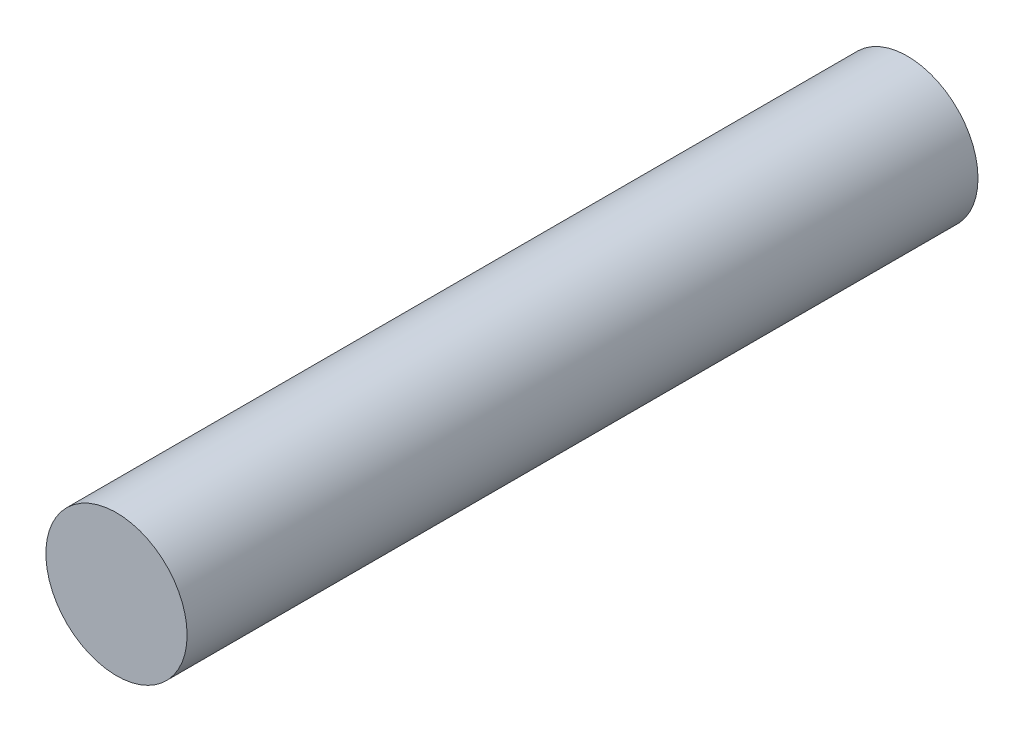
ISO-10303-21;
HEADER;
FILE_DESCRIPTION(('STEP AP214'),'2;1');
FILE_NAME('part.step','',(''),(''),'','','');
FILE_SCHEMA(('AUTOMOTIVE_DESIGN { 1 0 10303 214 1 1 1 1 }'));
ENDSEC;
DATA;
#1=APPLICATION_CONTEXT('core data for automotive mechanical design processes');
#2=APPLICATION_PROTOCOL_DEFINITION('international standard','automotive_design',2000,#1);
#3=PRODUCT_CONTEXT('',#1,'mechanical');
#4=PRODUCT('Part','Part','',(#3));
#5=PRODUCT_RELATED_PRODUCT_CATEGORY('part','',(#4));
#6=PRODUCT_DEFINITION_FORMATION('','',#4);
#7=PRODUCT_DEFINITION_CONTEXT('part definition',#1,'design');
#8=PRODUCT_DEFINITION('design','',#6,#7);
#9=PRODUCT_DEFINITION_SHAPE('','',#8);
#10=(LENGTH_UNIT() NAMED_UNIT(*) SI_UNIT(.MILLI.,.METRE.));
#11=(NAMED_UNIT(*) PLANE_ANGLE_UNIT() SI_UNIT($,.RADIAN.));
#12=(NAMED_UNIT(*) SI_UNIT($,.STERADIAN.) SOLID_ANGLE_UNIT());
#13=UNCERTAINTY_MEASURE_WITH_UNIT(LENGTH_MEASURE(1.E-05),#10,'distance_accuracy_value','');
#14=(GEOMETRIC_REPRESENTATION_CONTEXT(3) GLOBAL_UNCERTAINTY_ASSIGNED_CONTEXT((#13)) GLOBAL_UNIT_ASSIGNED_CONTEXT((#10,
#11,#12)) REPRESENTATION_CONTEXT('',''));
#15=CARTESIAN_POINT('',(0.,0.,0.));
#16=DIRECTION('',(0.,0.,1.));
#17=DIRECTION('',(1.,0.,0.));
#18=AXIS2_PLACEMENT_3D('',#15,#16,#17);
#19=CARTESIAN_POINT('',(0.,0.,112.));
#20=DIRECTION('',(0.,0.,-1.));
#21=DIRECTION('',(-1.,0.,0.));
#22=AXIS2_PLACEMENT_3D('',#19,#20,#21);
#23=CYLINDRICAL_SURFACE('',#22,17.5);
#24=CARTESIAN_POINT('',(0.,0.,112.));
#25=DIRECTION('',(0.,0.,1.));
#26=DIRECTION('',(1.,0.,0.));
#27=AXIS2_PLACEMENT_3D('',#24,#25,#26);
#28=CIRCLE('',#27,17.5);
#29=CARTESIAN_POINT('',(17.5,0.,112.));
#30=VERTEX_POINT('',#29);
#31=EDGE_CURVE('E10',#30,#30,#28,.T.);
#32=ORIENTED_EDGE('',*,*,#31,.F.);
#33=EDGE_LOOP('',(#32));
#34=FACE_BOUND('',#33,.T.);
#35=CARTESIAN_POINT('',(0.,0.,-84.));
#36=DIRECTION('',(0.,0.,1.));
#37=DIRECTION('',(1.,0.,0.));
#38=AXIS2_PLACEMENT_3D('',#35,#36,#37);
#39=CIRCLE('',#38,17.5);
#40=CARTESIAN_POINT('',(17.5,0.,-84.));
#41=VERTEX_POINT('',#40);
#42=EDGE_CURVE('E39',#41,#41,#39,.T.);
#43=ORIENTED_EDGE('',*,*,#42,.T.);
#44=EDGE_LOOP('',(#43));
#45=FACE_BOUND('',#44,.T.);
#46=ADVANCED_FACE('F36',(#34,#45),#23,.T.);
#47=CARTESIAN_POINT('',(0.,0.,112.));
#48=DIRECTION('',(0.,0.,1.));
#49=DIRECTION('',(1.,0.,0.));
#50=AXIS2_PLACEMENT_3D('',#47,#48,#49);
#51=PLANE('',#50);
#52=ORIENTED_EDGE('',*,*,#31,.T.);
#53=EDGE_LOOP('',(#52));
#54=FACE_BOUND('',#53,.T.);
#55=ADVANCED_FACE('F53',(#54),#51,.T.);
#56=CARTESIAN_POINT('',(0.,0.,-84.));
#57=DIRECTION('',(0.,0.,1.));
#58=DIRECTION('',(1.,0.,0.));
#59=AXIS2_PLACEMENT_3D('',#56,#57,#58);
#60=PLANE('',#59);
#61=ORIENTED_EDGE('',*,*,#42,.F.);
#62=EDGE_LOOP('',(#61));
#63=FACE_BOUND('',#62,.T.);
#64=ADVANCED_FACE('F51',(#63),#60,.F.);
#65=CLOSED_SHELL('',(#46,#55,#64));
#66=MANIFOLD_SOLID_BREP('B2',#65);
#67=ADVANCED_BREP_SHAPE_REPRESENTATION('',(#18,#66),#14);
#68=SHAPE_DEFINITION_REPRESENTATION(#9,#67);
ENDSEC;
END-ISO-10303-21;
